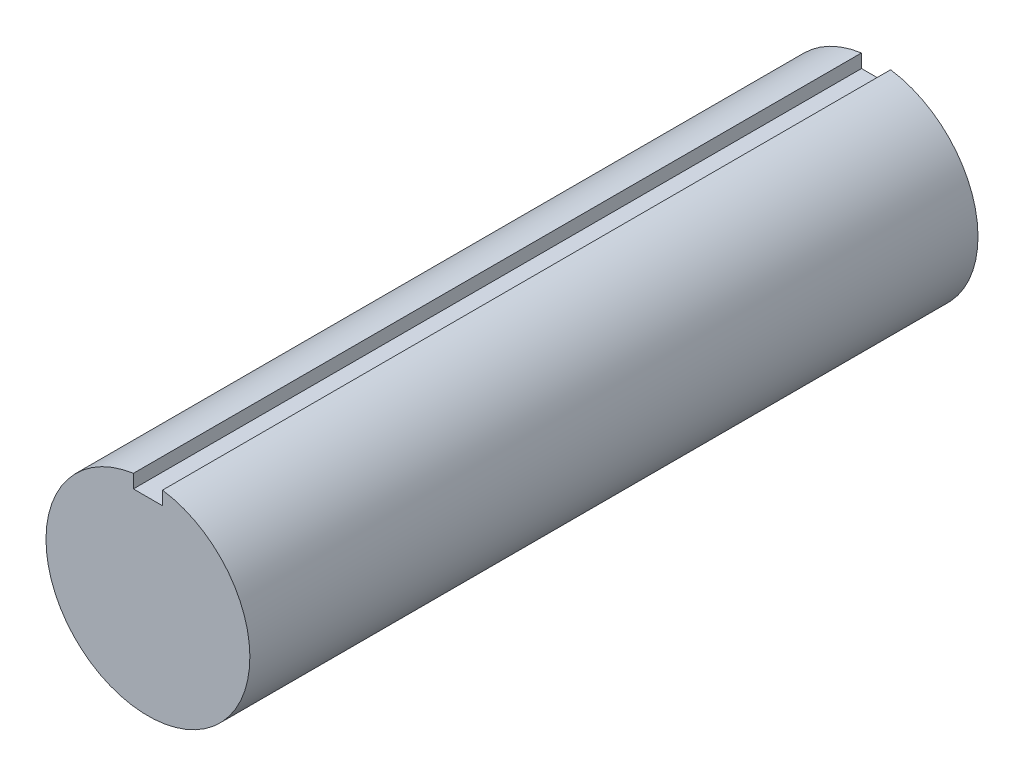
ISO-10303-21;
HEADER;
FILE_DESCRIPTION(('STEP AP214'),'2;1');
FILE_NAME('part.step','',(''),(''),'','','');
FILE_SCHEMA(('AUTOMOTIVE_DESIGN { 1 0 10303 214 1 1 1 1 }'));
ENDSEC;
DATA;
#1=APPLICATION_CONTEXT('core data for automotive mechanical design processes');
#2=APPLICATION_PROTOCOL_DEFINITION('international standard','automotive_design',2000,#1);
#3=PRODUCT_CONTEXT('',#1,'mechanical');
#4=PRODUCT('Part','Part','',(#3));
#5=PRODUCT_RELATED_PRODUCT_CATEGORY('part','',(#4));
#6=PRODUCT_DEFINITION_FORMATION('','',#4);
#7=PRODUCT_DEFINITION_CONTEXT('part definition',#1,'design');
#8=PRODUCT_DEFINITION('design','',#6,#7);
#9=PRODUCT_DEFINITION_SHAPE('','',#8);
#10=(LENGTH_UNIT() NAMED_UNIT(*) SI_UNIT(.MILLI.,.METRE.));
#11=(NAMED_UNIT(*) PLANE_ANGLE_UNIT() SI_UNIT($,.RADIAN.));
#12=(NAMED_UNIT(*) SI_UNIT($,.STERADIAN.) SOLID_ANGLE_UNIT());
#13=UNCERTAINTY_MEASURE_WITH_UNIT(LENGTH_MEASURE(1.E-05),#10,'distance_accuracy_value','');
#14=(GEOMETRIC_REPRESENTATION_CONTEXT(3) GLOBAL_UNCERTAINTY_ASSIGNED_CONTEXT((#13)) GLOBAL_UNIT_ASSIGNED_CONTEXT((#10,
#11,#12)) REPRESENTATION_CONTEXT('',''));
#15=CARTESIAN_POINT('',(0.,0.,0.));
#16=DIRECTION('',(0.,0.,1.));
#17=DIRECTION('',(1.,0.,0.));
#18=AXIS2_PLACEMENT_3D('',#15,#16,#17);
#19=CARTESIAN_POINT('',(-1.,0.,50.));
#20=DIRECTION('',(1.,0.,0.));
#21=DIRECTION('',(0.,1.,0.));
#22=AXIS2_PLACEMENT_3D('',#19,#20,#21);
#23=PLANE('',#22);
#24=DIRECTION('',(0.,1.,0.));
#25=VECTOR('',#24,1.);
#26=CARTESIAN_POINT('',(-1.,0.,0.));
#27=LINE('',#26,#25);
#28=CARTESIAN_POINT('',(-1.,6.,0.));
#29=VERTEX_POINT('',#28);
#30=CARTESIAN_POINT('',(-1.,6.92820323027551,0.));
#31=VERTEX_POINT('',#30);
#32=EDGE_CURVE('E120',#29,#31,#27,.T.);
#33=ORIENTED_EDGE('',*,*,#32,.T.);
#34=DIRECTION('',(0.,0.,-1.));
#35=VECTOR('',#34,1.);
#36=CARTESIAN_POINT('',(-1.,6.92820323027551,50.));
#37=LINE('',#36,#35);
#38=CARTESIAN_POINT('',(-1.,6.92820323027551,50.));
#39=VERTEX_POINT('',#38);
#40=EDGE_CURVE('E111',#39,#31,#37,.T.);
#41=ORIENTED_EDGE('',*,*,#40,.F.);
#42=DIRECTION('',(0.,1.,0.));
#43=VECTOR('',#42,1.);
#44=CARTESIAN_POINT('',(-1.,0.,50.));
#45=LINE('',#44,#43);
#46=CARTESIAN_POINT('',(-1.,6.,50.));
#47=VERTEX_POINT('',#46);
#48=EDGE_CURVE('E102',#47,#39,#45,.T.);
#49=ORIENTED_EDGE('',*,*,#48,.F.);
#50=DIRECTION('',(0.,0.,-1.));
#51=VECTOR('',#50,1.);
#52=CARTESIAN_POINT('',(-1.,6.,50.));
#53=LINE('',#52,#51);
#54=EDGE_CURVE('E58',#47,#29,#53,.T.);
#55=ORIENTED_EDGE('',*,*,#54,.T.);
#56=EDGE_LOOP('',(#33,#41,#49,#55));
#57=FACE_BOUND('',#56,.T.);
#58=ADVANCED_FACE('F45',(#57),#23,.T.);
#59=CARTESIAN_POINT('',(0.,6.,50.));
#60=DIRECTION('',(0.,1.,0.));
#61=DIRECTION('',(0.,0.,-1.));
#62=AXIS2_PLACEMENT_3D('',#59,#60,#61);
#63=PLANE('',#62);
#64=DIRECTION('',(-1.,0.,0.));
#65=VECTOR('',#64,1.);
#66=CARTESIAN_POINT('',(0.,6.,0.));
#67=LINE('',#66,#65);
#68=CARTESIAN_POINT('',(1.,6.,0.));
#69=VERTEX_POINT('',#68);
#70=EDGE_CURVE('E89',#69,#29,#67,.T.);
#71=ORIENTED_EDGE('',*,*,#70,.T.);
#72=ORIENTED_EDGE('',*,*,#54,.F.);
#73=DIRECTION('',(-1.,0.,0.));
#74=VECTOR('',#73,1.);
#75=CARTESIAN_POINT('',(0.,6.,50.));
#76=LINE('',#75,#74);
#77=CARTESIAN_POINT('',(1.,6.,50.));
#78=VERTEX_POINT('',#77);
#79=EDGE_CURVE('E66',#78,#47,#76,.T.);
#80=ORIENTED_EDGE('',*,*,#79,.F.);
#81=DIRECTION('',(0.,0.,-1.));
#82=VECTOR('',#81,1.);
#83=CARTESIAN_POINT('',(1.,6.,50.));
#84=LINE('',#83,#82);
#85=EDGE_CURVE('E110',#78,#69,#84,.T.);
#86=ORIENTED_EDGE('',*,*,#85,.T.);
#87=EDGE_LOOP('',(#71,#72,#80,#86));
#88=FACE_BOUND('',#87,.T.);
#89=ADVANCED_FACE('F151',(#88),#63,.T.);
#90=CARTESIAN_POINT('',(1.,0.,50.));
#91=DIRECTION('',(-1.,0.,0.));
#92=DIRECTION('',(0.,-1.,0.));
#93=AXIS2_PLACEMENT_3D('',#90,#91,#92);
#94=PLANE('',#93);
#95=DIRECTION('',(0.,-1.,0.));
#96=VECTOR('',#95,1.);
#97=CARTESIAN_POINT('',(1.,0.,0.));
#98=LINE('',#97,#96);
#99=CARTESIAN_POINT('',(1.,6.92820323027551,0.));
#100=VERTEX_POINT('',#99);
#101=EDGE_CURVE('E83',#100,#69,#98,.T.);
#102=ORIENTED_EDGE('',*,*,#101,.T.);
#103=ORIENTED_EDGE('',*,*,#85,.F.);
#104=DIRECTION('',(0.,-1.,0.));
#105=VECTOR('',#104,1.);
#106=CARTESIAN_POINT('',(1.,0.,50.));
#107=LINE('',#106,#105);
#108=CARTESIAN_POINT('',(1.,6.92820323027551,50.));
#109=VERTEX_POINT('',#108);
#110=EDGE_CURVE('E100',#109,#78,#107,.T.);
#111=ORIENTED_EDGE('',*,*,#110,.F.);
#112=DIRECTION('',(0.,0.,-1.));
#113=VECTOR('',#112,1.);
#114=CARTESIAN_POINT('',(1.,6.92820323027551,50.));
#115=LINE('',#114,#113);
#116=EDGE_CURVE('E106',#109,#100,#115,.T.);
#117=ORIENTED_EDGE('',*,*,#116,.T.);
#118=EDGE_LOOP('',(#102,#103,#111,#117));
#119=FACE_BOUND('',#118,.T.);
#120=ADVANCED_FACE('F113',(#119),#94,.T.);
#121=CARTESIAN_POINT('',(0.,0.,50.));
#122=DIRECTION('',(0.,0.,-1.));
#123=DIRECTION('',(1.,0.,0.));
#124=AXIS2_PLACEMENT_3D('',#121,#122,#123);
#125=CYLINDRICAL_SURFACE('',#124,7.);
#126=CARTESIAN_POINT('',(0.,-7.,8.));
#127=CARTESIAN_POINT('',(-0.160281740269091,-6.9999940839629,8.00000746958146));
#128=CARTESIAN_POINT('',(-0.320833907522429,-6.99443250051265,8.01292131609655));
#129=CARTESIAN_POINT('',(-0.637349314958984,-6.97273920628719,8.06408236542645));
#130=CARTESIAN_POINT('',(-0.793299928144206,-6.95658080950724,8.10239352907334));
#131=CARTESIAN_POINT('',(-1.0955347051483,-6.91541630739345,8.20266976362512));
#132=CARTESIAN_POINT('',(-1.24185033642246,-6.89044089228941,8.2645528438054));
#133=CARTESIAN_POINT('',(-1.5218733278968,-6.83405660276648,8.40986441856373));
#134=CARTESIAN_POINT('',(-1.6555840905338,-6.80264947176647,8.49328707609181));
#135=CARTESIAN_POINT('',(-1.91384144205639,-6.7346782187555,8.6839276476879));
#136=CARTESIAN_POINT('',(-2.03764045493602,-6.69793895962371,8.79209525989578));
#137=CARTESIAN_POINT('',(-2.26599040232609,-6.62417654338771,9.02714386850078));
#138=CARTESIAN_POINT('',(-2.3705306503261,-6.5871532404671,9.15403518460272));
#139=CARTESIAN_POINT('',(-2.56285686126492,-6.51482055271223,9.4310327227155));
#140=CARTESIAN_POINT('',(-2.64946811752636,-6.47970460244924,9.58201045802931));
#141=CARTESIAN_POINT('',(-2.79573199408101,-6.41796168635027,9.89810942818896));
#142=CARTESIAN_POINT('',(-2.8553992914263,-6.39133010120133,10.0632229044862));
#143=CARTESIAN_POINT('',(-2.94294919918374,-6.35147799087276,10.3943007383092));
#144=CARTESIAN_POINT('',(-2.97227494401776,-6.3376522143554,10.5598077017794));
#145=CARTESIAN_POINT('',(-3.00280607158394,-6.32324849688131,10.8939259696103));
#146=CARTESIAN_POINT('',(-3.00402828615096,-6.32266262625149,11.0625353552914));
#147=CARTESIAN_POINT('',(-2.97939999510613,-6.33429573902539,11.3832999037185));
#148=CARTESIAN_POINT('',(-2.95576113815072,-6.34546870930158,11.535670623332));
#149=CARTESIAN_POINT('',(-2.88580772808799,-6.37758411517576,11.8340275859013));
#150=CARTESIAN_POINT('',(-2.83948852833539,-6.39852855266592,11.9800125138861));
#151=CARTESIAN_POINT('',(-2.7245765907069,-6.44830685655466,12.2652471514352));
#152=CARTESIAN_POINT('',(-2.65551974428426,-6.47730295111391,12.4042802942181));
#153=CARTESIAN_POINT('',(-2.49742304873013,-6.53988493882129,12.6693463240694));
#154=CARTESIAN_POINT('',(-2.40837507480489,-6.57347269593628,12.7953738949295));
#155=CARTESIAN_POINT('',(-2.20343405392229,-6.64512404535213,13.0427775036214));
#156=CARTESIAN_POINT('',(-2.08584728856133,-6.68331855389209,13.162716729472));
#157=CARTESIAN_POINT('',(-1.83187332405076,-6.75734605758523,13.3816715906559));
#158=CARTESIAN_POINT('',(-1.6954812162799,-6.79317843254652,13.4806817458782));
#159=CARTESIAN_POINT('',(-1.40318582301271,-6.8595969368957,13.657243932807));
#160=CARTESIAN_POINT('',(-1.24687114970231,-6.89002455033727,13.7341790187056));
#161=CARTESIAN_POINT('',(-0.921879694158933,-6.94097396260558,13.8601502376147));
#162=CARTESIAN_POINT('',(-0.753210215657664,-6.9615015603998,13.9092027059777));
#163=CARTESIAN_POINT('',(-0.42027623894137,-6.98923526893385,13.974933860459));
#164=CARTESIAN_POINT('',(-0.256457961010924,-6.99723249964589,13.9935387653144));
#165=CARTESIAN_POINT('',(0.0721433011185079,-7.00155416651738,14.0036295764082));
#166=CARTESIAN_POINT('',(0.236925971900557,-6.99788220531666,13.9951238525324));
#167=CARTESIAN_POINT('',(0.553542439626672,-6.9797867632015,13.9525843679452));
#168=CARTESIAN_POINT('',(0.705598931504219,-6.96594519473644,13.9199316785517));
#169=CARTESIAN_POINT('',(1.00189113639242,-6.92953888009974,13.8319791057618));
#170=CARTESIAN_POINT('',(1.14612587370002,-6.90697304848521,13.7766764042778));
#171=CARTESIAN_POINT('',(1.42777696523888,-6.85438751513719,13.6431988404979));
#172=CARTESIAN_POINT('',(1.56483974951837,-6.82415705388474,13.5643636697739));
#173=CARTESIAN_POINT('',(1.82428490564705,-6.75942988391438,13.3867810555241));
#174=CARTESIAN_POINT('',(1.94666097512992,-6.72493135648759,13.2880251119767));
#175=CARTESIAN_POINT('',(2.18296759532596,-6.65214788697904,13.0647104121571));
#176=CARTESIAN_POINT('',(2.29556617553686,-6.61377354998591,12.9387677899386));
#177=CARTESIAN_POINT('',(2.49843431443676,-6.53984037690252,12.6692177013684));
#178=CARTESIAN_POINT('',(2.58869766421195,-6.50428232556792,12.5256053396252));
#179=CARTESIAN_POINT('',(2.74563875632303,-6.43962969285319,12.2211861470414));
#180=CARTESIAN_POINT('',(2.81186415020233,-6.41066255987443,12.06011699095));
#181=CARTESIAN_POINT('',(2.91565885028324,-6.36413607530146,11.7274736732605));
#182=CARTESIAN_POINT('',(2.95325364225748,-6.346566580073,11.5559090016754));
#183=CARTESIAN_POINT('',(2.9961194841997,-6.32643481136621,11.2220088276671));
#184=CARTESIAN_POINT('',(3.00374693238451,-6.3227792566546,11.0600407324894));
#185=CARTESIAN_POINT('',(2.99282649265778,-6.32795618271386,10.7372102530885));
#186=CARTESIAN_POINT('',(2.97428322126543,-6.33678646098226,10.5763476788807));
#187=CARTESIAN_POINT('',(2.91356431394149,-6.3649165389077,10.2689583037266));
#188=CARTESIAN_POINT('',(2.87266975661121,-6.38364713099396,10.1221212084293));
#189=CARTESIAN_POINT('',(2.769702223632,-6.42898875831973,9.83737923391612));
#190=CARTESIAN_POINT('',(2.70762322652259,-6.45560203384716,9.69947690759226));
#191=CARTESIAN_POINT('',(2.55963250501149,-6.5157524732596,9.42717929132044));
#192=CARTESIAN_POINT('',(2.47248232196069,-6.5496164957701,9.29353084630524));
#193=CARTESIAN_POINT('',(2.2784960092513,-6.61959778926566,9.04201763875246));
#194=CARTESIAN_POINT('',(2.17165243666714,-6.6557159087398,8.92415887295079));
#195=CARTESIAN_POINT('',(1.93135048700133,-6.72955424641834,8.69799636449928));
#196=CARTESIAN_POINT('',(1.79645724733279,-6.76717599448736,8.59118043442724));
#197=CARTESIAN_POINT('',(1.50919760355001,-6.83696477009089,8.40156023996883));
#198=CARTESIAN_POINT('',(1.35682332068822,-6.86912932173672,8.31876686240015));
#199=CARTESIAN_POINT('',(1.11954532843042,-6.91035442086787,8.21540730901047));
#200=CARTESIAN_POINT('',(1.03957288024831,-6.92286397965452,8.18456670919816));
#201=CARTESIAN_POINT('',(0.876970802782694,-6.94533202163241,8.1297617979777));
#202=CARTESIAN_POINT('',(0.794342461515165,-6.95529172101821,8.10579420772464));
#203=CARTESIAN_POINT('',(0.627265567421396,-6.97234378079151,8.06505228271658));
#204=CARTESIAN_POINT('',(0.542821986677286,-6.97944312738119,8.04826041561952));
#205=CARTESIAN_POINT('',(0.372647906839315,-6.99059319635284,8.02199128579659));
#206=CARTESIAN_POINT('',(0.286918376030205,-6.99464610559385,8.0125087759861));
#207=CARTESIAN_POINT('',(0.167492669563776,-6.99807592564236,8.00449172505644));
#208=CARTESIAN_POINT('',(0.134021137958667,-6.99879677015532,8.00280814588237));
#209=CARTESIAN_POINT('',(0.0670370145842116,-6.99975942751561,8.00056149871593));
#210=CARTESIAN_POINT('',(0.0335244225617061,-7.0000012373944,7.99999843766729));
#211=CARTESIAN_POINT('',(0.,-7.,8.));
#212=B_SPLINE_CURVE_WITH_KNOTS('',3,(#126,#127,#128,#129,#130,#131,#132,#133,#134,#135,#136,
#137,#138,#139,#140,#141,#142,#143,#144,#145,#146,#147,#148,#149,#150,#151,#152,#153,#154,#155,
#156,#157,#158,#159,#160,#161,#162,#163,#164,#165,#166,#167,#168,#169,#170,#171,#172,#173,#174,
#175,#176,#177,#178,#179,#180,#181,#182,#183,#184,#185,#186,#187,#188,#189,#190,#191,#192,#193,
#194,#195,#196,#197,#198,#199,#200,#201,#202,#203,#204,#205,#206,#207,#208,#209,#210,#211),
.UNSPECIFIED.,.T.,.F.,(4,2,2,2,2,2,2,2,2,2,2,2,2,2,2,2,2,2,2,2,2,2,2,2,2,2,2,2,2,2,2,2,2,2,2,2,
2,2,2,2,2,2,4),(0.,0.480714322748849,0.962643903423346,1.44291226275142,1.92305060961531,
2.42622743558506,2.92968263421743,3.45969560860062,3.98941952228262,4.492594268281,
4.99546764377914,5.45710720323576,5.91884138089947,6.3906540887232,6.86265889892285,
7.37709837725841,7.89167239108963,8.41947244601234,8.94696296364742,9.43957347502028,
9.93203191709568,10.3983119423363,10.8646499992176,11.3455505516221,11.8266567358409,
12.3440285038672,12.8615439335848,13.3883469079738,13.9146803943341,14.3986848887267,
14.882604015318,15.341320451094,15.8001673810816,16.2874475008663,16.7749121624767,
17.3008416934143,17.8270092002163,18.0865840789243,18.3460349177801,18.6048481685098,
18.8634754544625,18.964020720529,19.0645666096629),.UNSPECIFIED.);
#213=CARTESIAN_POINT('',(0.,-7.,8.));
#214=VERTEX_POINT('',#213);
#215=EDGE_CURVE('E11',#214,#214,#212,.T.);
#216=ORIENTED_EDGE('',*,*,#215,.T.);
#217=EDGE_LOOP('',(#216));
#218=FACE_BOUND('',#217,.T.);
#219=CARTESIAN_POINT('',(0.,0.,0.));
#220=DIRECTION('',(0.,0.,1.));
#221=DIRECTION('',(1.,0.,0.));
#222=AXIS2_PLACEMENT_3D('',#219,#220,#221);
#223=CIRCLE('',#222,7.);
#224=EDGE_CURVE('E108',#31,#100,#223,.T.);
#225=ORIENTED_EDGE('',*,*,#224,.T.);
#226=ORIENTED_EDGE('',*,*,#116,.F.);
#227=CARTESIAN_POINT('',(0.,0.,50.));
#228=DIRECTION('',(0.,0.,1.));
#229=DIRECTION('',(1.,0.,0.));
#230=AXIS2_PLACEMENT_3D('',#227,#228,#229);
#231=CIRCLE('',#230,7.);
#232=EDGE_CURVE('E97',#39,#109,#231,.T.);
#233=ORIENTED_EDGE('',*,*,#232,.F.);
#234=ORIENTED_EDGE('',*,*,#40,.T.);
#235=EDGE_LOOP('',(#225,#226,#233,#234));
#236=FACE_BOUND('',#235,.T.);
#237=ADVANCED_FACE('F107',(#218,#236),#125,.T.);
#238=CARTESIAN_POINT('',(0.,0.,50.));
#239=DIRECTION('',(0.,0.,-1.));
#240=DIRECTION('',(1.,0.,0.));
#241=AXIS2_PLACEMENT_3D('',#238,#239,#240);
#242=PLANE('',#241);
#243=ORIENTED_EDGE('',*,*,#48,.T.);
#244=ORIENTED_EDGE('',*,*,#232,.T.);
#245=ORIENTED_EDGE('',*,*,#110,.T.);
#246=ORIENTED_EDGE('',*,*,#79,.T.);
#247=EDGE_LOOP('',(#243,#244,#245,#246));
#248=FACE_BOUND('',#247,.T.);
#249=ADVANCED_FACE('F98',(#248),#242,.F.);
#250=CARTESIAN_POINT('',(0.,0.,0.));
#251=DIRECTION('',(0.,0.,-1.));
#252=DIRECTION('',(1.,0.,0.));
#253=AXIS2_PLACEMENT_3D('',#250,#251,#252);
#254=PLANE('',#253);
#255=ORIENTED_EDGE('',*,*,#32,.F.);
#256=ORIENTED_EDGE('',*,*,#70,.F.);
#257=ORIENTED_EDGE('',*,*,#101,.F.);
#258=ORIENTED_EDGE('',*,*,#224,.F.);
#259=EDGE_LOOP('',(#255,#256,#257,#258));
#260=FACE_BOUND('',#259,.T.);
#261=ADVANCED_FACE('F138',(#260),#254,.T.);
#262=CARTESIAN_POINT('',(0.,-7.,11.));
#263=DIRECTION('',(0.,1.,0.));
#264=DIRECTION('',(0.,0.,-1.));
#265=AXIS2_PLACEMENT_3D('',#262,#263,#264);
#266=CYLINDRICAL_SURFACE('',#265,3.);
#267=ORIENTED_EDGE('',*,*,#215,.F.);
#268=EDGE_LOOP('',(#267));
#269=FACE_BOUND('',#268,.T.);
#270=CARTESIAN_POINT('',(0.,-5.,11.));
#271=DIRECTION('',(0.,-1.,0.));
#272=DIRECTION('',(0.,0.,-1.));
#273=AXIS2_PLACEMENT_3D('',#270,#271,#272);
#274=CIRCLE('',#273,3.);
#275=CARTESIAN_POINT('',(0.,-5.,8.));
#276=VERTEX_POINT('',#275);
#277=EDGE_CURVE('E124',#276,#276,#274,.T.);
#278=ORIENTED_EDGE('',*,*,#277,.F.);
#279=EDGE_LOOP('',(#278));
#280=FACE_BOUND('',#279,.T.);
#281=ADVANCED_FACE('F140',(#269,#280),#266,.F.);
#282=CARTESIAN_POINT('',(0.,-5.,11.));
#283=DIRECTION('',(0.,1.,0.));
#284=DIRECTION('',(0.,0.,-1.));
#285=AXIS2_PLACEMENT_3D('',#282,#283,#284);
#286=PLANE('',#285);
#287=ORIENTED_EDGE('',*,*,#277,.T.);
#288=EDGE_LOOP('',(#287));
#289=FACE_BOUND('',#288,.T.);
#290=ADVANCED_FACE('F146',(#289),#286,.F.);
#291=CLOSED_SHELL('',(#58,#89,#120,#237,#249,#261,#281,#290));
#292=MANIFOLD_SOLID_BREP('B2',#291);
#293=ADVANCED_BREP_SHAPE_REPRESENTATION('',(#18,#292),#14);
#294=SHAPE_DEFINITION_REPRESENTATION(#9,#293);
ENDSEC;
END-ISO-10303-21;
